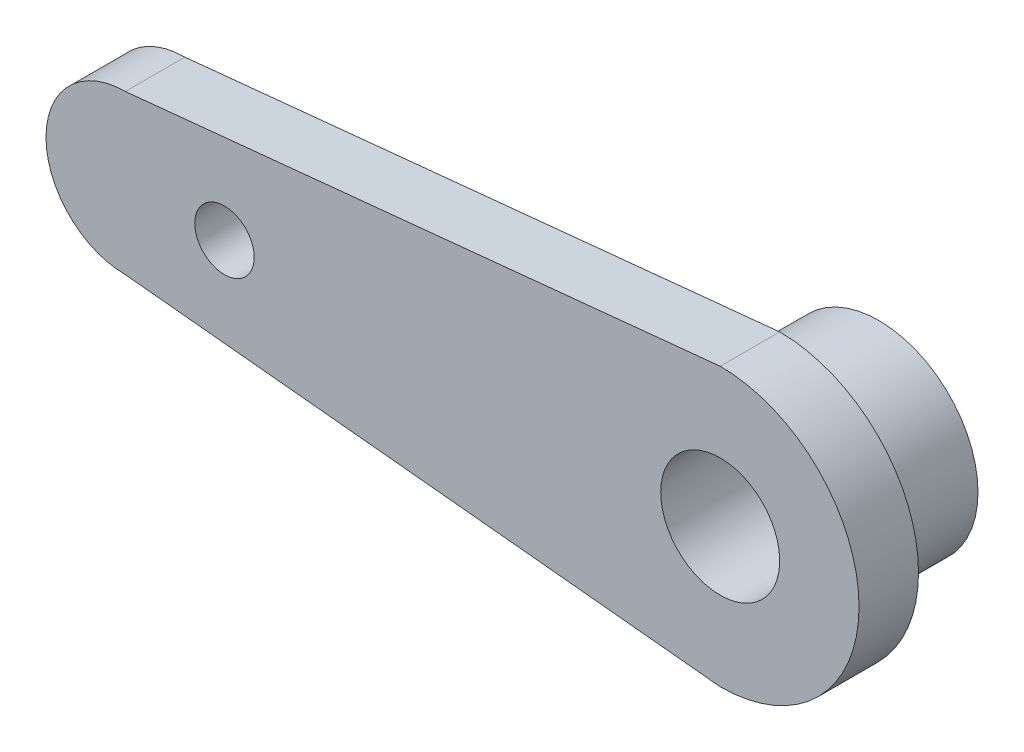
ISO-10303-21;
HEADER;
FILE_DESCRIPTION(('STEP AP214'),'2;1');
FILE_NAME('part.step','',(''),(''),'','','');
FILE_SCHEMA(('AUTOMOTIVE_DESIGN { 1 0 10303 214 1 1 1 1 }'));
ENDSEC;
DATA;
#1=APPLICATION_CONTEXT('core data for automotive mechanical design processes');
#2=APPLICATION_PROTOCOL_DEFINITION('international standard','automotive_design',2000,#1);
#3=PRODUCT_CONTEXT('',#1,'mechanical');
#4=PRODUCT('Part','Part','',(#3));
#5=PRODUCT_RELATED_PRODUCT_CATEGORY('part','',(#4));
#6=PRODUCT_DEFINITION_FORMATION('','',#4);
#7=PRODUCT_DEFINITION_CONTEXT('part definition',#1,'design');
#8=PRODUCT_DEFINITION('design','',#6,#7);
#9=PRODUCT_DEFINITION_SHAPE('','',#8);
#10=(LENGTH_UNIT() NAMED_UNIT(*) SI_UNIT(.MILLI.,.METRE.));
#11=(NAMED_UNIT(*) PLANE_ANGLE_UNIT() SI_UNIT($,.RADIAN.));
#12=(NAMED_UNIT(*) SI_UNIT($,.STERADIAN.) SOLID_ANGLE_UNIT());
#13=UNCERTAINTY_MEASURE_WITH_UNIT(LENGTH_MEASURE(1.E-05),#10,'distance_accuracy_value','');
#14=(GEOMETRIC_REPRESENTATION_CONTEXT(3) GLOBAL_UNCERTAINTY_ASSIGNED_CONTEXT((#13)) GLOBAL_UNIT_ASSIGNED_CONTEXT((#10,
#11,#12)) REPRESENTATION_CONTEXT('',''));
#15=CARTESIAN_POINT('',(0.,0.,0.));
#16=DIRECTION('',(0.,0.,1.));
#17=DIRECTION('',(1.,0.,0.));
#18=AXIS2_PLACEMENT_3D('',#15,#16,#17);
#19=CARTESIAN_POINT('',(0.,0.,0.));
#20=DIRECTION('',(0.,0.,1.));
#21=DIRECTION('',(1.,0.,0.));
#22=AXIS2_PLACEMENT_3D('',#19,#20,#21);
#23=PLANE('',#22);
#24=CARTESIAN_POINT('',(0.,0.,0.));
#25=DIRECTION('',(0.,0.,1.));
#26=DIRECTION('',(1.,0.,0.));
#27=AXIS2_PLACEMENT_3D('',#24,#25,#26);
#28=CIRCLE('',#27,5.);
#29=CARTESIAN_POINT('',(5.,0.,0.));
#30=VERTEX_POINT('',#29);
#31=EDGE_CURVE('E36',#30,#30,#28,.T.);
#32=ORIENTED_EDGE('',*,*,#31,.F.);
#33=EDGE_LOOP('',(#32));
#34=FACE_BOUND('',#33,.T.);
#35=CARTESIAN_POINT('',(0.,0.,0.));
#36=DIRECTION('',(0.,0.,1.));
#37=DIRECTION('',(1.,0.,0.));
#38=AXIS2_PLACEMENT_3D('',#35,#36,#37);
#39=CIRCLE('',#38,3.);
#40=CARTESIAN_POINT('',(3.,0.,0.));
#41=VERTEX_POINT('',#40);
#42=EDGE_CURVE('E110',#41,#41,#39,.T.);
#43=ORIENTED_EDGE('',*,*,#42,.T.);
#44=EDGE_LOOP('',(#43));
#45=FACE_BOUND('',#44,.T.);
#46=ADVANCED_FACE('F32',(#34,#45),#23,.F.);
#47=CARTESIAN_POINT('',(0.,0.,5.));
#48=DIRECTION('',(0.,0.,-1.));
#49=DIRECTION('',(-1.,0.,0.));
#50=AXIS2_PLACEMENT_3D('',#47,#48,#49);
#51=CYLINDRICAL_SURFACE('',#50,5.);
#52=CARTESIAN_POINT('',(0.,0.,5.));
#53=DIRECTION('',(0.,0.,1.));
#54=DIRECTION('',(1.,0.,0.));
#55=AXIS2_PLACEMENT_3D('',#52,#53,#54);
#56=CIRCLE('',#55,5.);
#57=CARTESIAN_POINT('',(5.,0.,5.));
#58=VERTEX_POINT('',#57);
#59=EDGE_CURVE('E11',#58,#58,#56,.T.);
#60=ORIENTED_EDGE('',*,*,#59,.F.);
#61=EDGE_LOOP('',(#60));
#62=FACE_BOUND('',#61,.T.);
#63=ORIENTED_EDGE('',*,*,#31,.T.);
#64=EDGE_LOOP('',(#63));
#65=FACE_BOUND('',#64,.T.);
#66=ADVANCED_FACE('F34',(#62,#65),#51,.T.);
#67=CARTESIAN_POINT('',(0.,0.,5.));
#68=DIRECTION('',(0.,0.,-1.));
#69=DIRECTION('',(-1.,0.,0.));
#70=AXIS2_PLACEMENT_3D('',#67,#68,#69);
#71=CYLINDRICAL_SURFACE('',#70,3.);
#72=ORIENTED_EDGE('',*,*,#42,.F.);
#73=EDGE_LOOP('',(#72));
#74=FACE_BOUND('',#73,.T.);
#75=CARTESIAN_POINT('',(0.,0.,8.));
#76=DIRECTION('',(0.,0.,-1.));
#77=DIRECTION('',(-1.,0.,0.));
#78=AXIS2_PLACEMENT_3D('',#75,#76,#77);
#79=CIRCLE('',#78,3.);
#80=CARTESIAN_POINT('',(-3.,0.,8.));
#81=VERTEX_POINT('',#80);
#82=EDGE_CURVE('E157',#81,#81,#79,.T.);
#83=ORIENTED_EDGE('',*,*,#82,.F.);
#84=EDGE_LOOP('',(#83));
#85=FACE_BOUND('',#84,.T.);
#86=ADVANCED_FACE('F122',(#74,#85),#71,.F.);
#87=CARTESIAN_POINT('',(-30.,0.,8.));
#88=DIRECTION('',(0.,0.,-1.));
#89=DIRECTION('',(-1.,0.,0.));
#90=AXIS2_PLACEMENT_3D('',#87,#88,#89);
#91=CYLINDRICAL_SURFACE('',#90,4.);
#92=CARTESIAN_POINT('',(-30.,0.,5.));
#93=DIRECTION('',(0.,0.,1.));
#94=DIRECTION('',(1.,0.,0.));
#95=AXIS2_PLACEMENT_3D('',#92,#93,#94);
#96=CIRCLE('',#95,4.);
#97=CARTESIAN_POINT('',(-30.,4.,5.));
#98=VERTEX_POINT('',#97);
#99=CARTESIAN_POINT('',(-30.,-4.,5.));
#100=VERTEX_POINT('',#99);
#101=EDGE_CURVE('E100',#98,#100,#96,.T.);
#102=ORIENTED_EDGE('',*,*,#101,.T.);
#103=DIRECTION('',(0.,0.,-1.));
#104=VECTOR('',#103,1.);
#105=CARTESIAN_POINT('',(-30.,-4.,8.));
#106=LINE('',#105,#104);
#107=CARTESIAN_POINT('',(-30.,-4.,8.));
#108=VERTEX_POINT('',#107);
#109=EDGE_CURVE('E91',#108,#100,#106,.T.);
#110=ORIENTED_EDGE('',*,*,#109,.F.);
#111=CARTESIAN_POINT('',(-30.,0.,8.));
#112=DIRECTION('',(0.,0.,1.));
#113=DIRECTION('',(1.,0.,0.));
#114=AXIS2_PLACEMENT_3D('',#111,#112,#113);
#115=CIRCLE('',#114,4.);
#116=CARTESIAN_POINT('',(-30.,4.,8.));
#117=VERTEX_POINT('',#116);
#118=EDGE_CURVE('E85',#117,#108,#115,.T.);
#119=ORIENTED_EDGE('',*,*,#118,.F.);
#120=DIRECTION('',(0.,0.,-1.));
#121=VECTOR('',#120,1.);
#122=CARTESIAN_POINT('',(-30.,4.,8.));
#123=LINE('',#122,#121);
#124=EDGE_CURVE('E96',#117,#98,#123,.T.);
#125=ORIENTED_EDGE('',*,*,#124,.T.);
#126=EDGE_LOOP('',(#102,#110,#119,#125));
#127=FACE_BOUND('',#126,.T.);
#128=ADVANCED_FACE('F127',(#127),#91,.T.);
#129=CARTESIAN_POINT('',(-30.,-4.,8.));
#130=DIRECTION('',(0.099503719020999,0.995037190209989,0.));
#131=DIRECTION('',(-0.995037190209989,0.099503719020999,0.));
#132=AXIS2_PLACEMENT_3D('',#129,#130,#131);
#133=PLANE('',#132);
#134=DIRECTION('',(0.995037190209989,-0.0995037190209989,0.));
#135=VECTOR('',#134,1.);
#136=CARTESIAN_POINT('',(-30.,-4.,5.));
#137=LINE('',#136,#135);
#138=CARTESIAN_POINT('',(0.,-7.,5.));
#139=VERTEX_POINT('',#138);
#140=EDGE_CURVE('E90',#100,#139,#137,.T.);
#141=ORIENTED_EDGE('',*,*,#140,.T.);
#142=DIRECTION('',(0.,0.,-1.));
#143=VECTOR('',#142,1.);
#144=CARTESIAN_POINT('',(0.,-7.,8.));
#145=LINE('',#144,#143);
#146=CARTESIAN_POINT('',(0.,-7.,8.));
#147=VERTEX_POINT('',#146);
#148=EDGE_CURVE('E88',#147,#139,#145,.T.);
#149=ORIENTED_EDGE('',*,*,#148,.F.);
#150=DIRECTION('',(0.995037190209989,-0.0995037190209989,0.));
#151=VECTOR('',#150,1.);
#152=CARTESIAN_POINT('',(-30.,-4.,8.));
#153=LINE('',#152,#151);
#154=EDGE_CURVE('E80',#108,#147,#153,.T.);
#155=ORIENTED_EDGE('',*,*,#154,.F.);
#156=ORIENTED_EDGE('',*,*,#109,.T.);
#157=EDGE_LOOP('',(#141,#149,#155,#156));
#158=FACE_BOUND('',#157,.T.);
#159=ADVANCED_FACE('F89',(#158),#133,.F.);
#160=CARTESIAN_POINT('',(0.,0.,8.));
#161=DIRECTION('',(0.,0.,-1.));
#162=DIRECTION('',(-1.,0.,0.));
#163=AXIS2_PLACEMENT_3D('',#160,#161,#162);
#164=CYLINDRICAL_SURFACE('',#163,7.);
#165=CARTESIAN_POINT('',(0.,0.,5.));
#166=DIRECTION('',(0.,0.,1.));
#167=DIRECTION('',(1.,0.,0.));
#168=AXIS2_PLACEMENT_3D('',#165,#166,#167);
#169=CIRCLE('',#168,7.);
#170=CARTESIAN_POINT('',(0.,7.,5.));
#171=VERTEX_POINT('',#170);
#172=EDGE_CURVE('E66',#139,#171,#169,.T.);
#173=ORIENTED_EDGE('',*,*,#172,.T.);
#174=DIRECTION('',(0.,0.,-1.));
#175=VECTOR('',#174,1.);
#176=CARTESIAN_POINT('',(0.,7.,8.));
#177=LINE('',#176,#175);
#178=CARTESIAN_POINT('',(0.,7.,8.));
#179=VERTEX_POINT('',#178);
#180=EDGE_CURVE('E92',#179,#171,#177,.T.);
#181=ORIENTED_EDGE('',*,*,#180,.F.);
#182=CARTESIAN_POINT('',(0.,0.,8.));
#183=DIRECTION('',(0.,0.,1.));
#184=DIRECTION('',(1.,0.,0.));
#185=AXIS2_PLACEMENT_3D('',#182,#183,#184);
#186=CIRCLE('',#185,7.);
#187=EDGE_CURVE('E83',#147,#179,#186,.T.);
#188=ORIENTED_EDGE('',*,*,#187,.F.);
#189=ORIENTED_EDGE('',*,*,#148,.T.);
#190=EDGE_LOOP('',(#173,#181,#188,#189));
#191=FACE_BOUND('',#190,.T.);
#192=ADVANCED_FACE('F94',(#191),#164,.T.);
#193=CARTESIAN_POINT('',(-30.,4.,8.));
#194=DIRECTION('',(0.099503719020999,-0.995037190209989,0.));
#195=DIRECTION('',(0.995037190209989,0.099503719020999,0.));
#196=AXIS2_PLACEMENT_3D('',#193,#194,#195);
#197=PLANE('',#196);
#198=DIRECTION('',(-0.995037190209989,-0.0995037190209989,0.));
#199=VECTOR('',#198,1.);
#200=CARTESIAN_POINT('',(-30.,4.,5.));
#201=LINE('',#200,#199);
#202=EDGE_CURVE('E72',#171,#98,#201,.T.);
#203=ORIENTED_EDGE('',*,*,#202,.T.);
#204=ORIENTED_EDGE('',*,*,#124,.F.);
#205=DIRECTION('',(-0.995037190209989,-0.0995037190209989,0.));
#206=VECTOR('',#205,1.);
#207=CARTESIAN_POINT('',(-30.,4.,8.));
#208=LINE('',#207,#206);
#209=EDGE_CURVE('E49',#179,#117,#208,.T.);
#210=ORIENTED_EDGE('',*,*,#209,.F.);
#211=ORIENTED_EDGE('',*,*,#180,.T.);
#212=EDGE_LOOP('',(#203,#204,#210,#211));
#213=FACE_BOUND('',#212,.T.);
#214=ADVANCED_FACE('F136',(#213),#197,.F.);
#215=CARTESIAN_POINT('',(-30.,0.,8.));
#216=DIRECTION('',(0.,0.,1.));
#217=DIRECTION('',(1.,0.,0.));
#218=AXIS2_PLACEMENT_3D('',#215,#216,#217);
#219=PLANE('',#218);
#220=ORIENTED_EDGE('',*,*,#82,.T.);
#221=EDGE_LOOP('',(#220));
#222=FACE_BOUND('',#221,.T.);
#223=CARTESIAN_POINT('',(-25.,0.,8.));
#224=DIRECTION('',(0.,0.,-1.));
#225=DIRECTION('',(-1.,0.,0.));
#226=AXIS2_PLACEMENT_3D('',#223,#224,#225);
#227=CIRCLE('',#226,1.5);
#228=CARTESIAN_POINT('',(-26.5,0.,8.));
#229=VERTEX_POINT('',#228);
#230=EDGE_CURVE('E103',#229,#229,#227,.T.);
#231=ORIENTED_EDGE('',*,*,#230,.T.);
#232=EDGE_LOOP('',(#231));
#233=FACE_BOUND('',#232,.T.);
#234=ORIENTED_EDGE('',*,*,#118,.T.);
#235=ORIENTED_EDGE('',*,*,#154,.T.);
#236=ORIENTED_EDGE('',*,*,#187,.T.);
#237=ORIENTED_EDGE('',*,*,#209,.T.);
#238=EDGE_LOOP('',(#234,#235,#236,#237));
#239=FACE_BOUND('',#238,.T.);
#240=ADVANCED_FACE('F81',(#222,#233,#239),#219,.T.);
#241=CARTESIAN_POINT('',(-30.,0.,5.));
#242=DIRECTION('',(0.,0.,1.));
#243=DIRECTION('',(1.,0.,0.));
#244=AXIS2_PLACEMENT_3D('',#241,#242,#243);
#245=PLANE('',#244);
#246=CARTESIAN_POINT('',(-25.,0.,5.));
#247=DIRECTION('',(0.,0.,-1.));
#248=DIRECTION('',(-1.,0.,0.));
#249=AXIS2_PLACEMENT_3D('',#246,#247,#248);
#250=CIRCLE('',#249,1.5);
#251=CARTESIAN_POINT('',(-26.5,0.,5.));
#252=VERTEX_POINT('',#251);
#253=EDGE_CURVE('E156',#252,#252,#250,.T.);
#254=ORIENTED_EDGE('',*,*,#253,.F.);
#255=EDGE_LOOP('',(#254));
#256=FACE_BOUND('',#255,.T.);
#257=ORIENTED_EDGE('',*,*,#59,.T.);
#258=EDGE_LOOP('',(#257));
#259=FACE_BOUND('',#258,.T.);
#260=ORIENTED_EDGE('',*,*,#101,.F.);
#261=ORIENTED_EDGE('',*,*,#202,.F.);
#262=ORIENTED_EDGE('',*,*,#172,.F.);
#263=ORIENTED_EDGE('',*,*,#140,.F.);
#264=EDGE_LOOP('',(#260,#261,#262,#263));
#265=FACE_BOUND('',#264,.T.);
#266=ADVANCED_FACE('F139',(#256,#259,#265),#245,.F.);
#267=CARTESIAN_POINT('',(-25.,0.,8.));
#268=DIRECTION('',(0.,0.,-1.));
#269=DIRECTION('',(-1.,0.,0.));
#270=AXIS2_PLACEMENT_3D('',#267,#268,#269);
#271=CYLINDRICAL_SURFACE('',#270,1.5);
#272=ORIENTED_EDGE('',*,*,#230,.F.);
#273=EDGE_LOOP('',(#272));
#274=FACE_BOUND('',#273,.T.);
#275=ORIENTED_EDGE('',*,*,#253,.T.);
#276=EDGE_LOOP('',(#275));
#277=FACE_BOUND('',#276,.T.);
#278=ADVANCED_FACE('F142',(#274,#277),#271,.F.);
#279=CLOSED_SHELL('',(#46,#66,#86,#128,#159,#192,#214,#240,#266,#278));
#280=MANIFOLD_SOLID_BREP('B2',#279);
#281=ADVANCED_BREP_SHAPE_REPRESENTATION('',(#18,#280),#14);
#282=SHAPE_DEFINITION_REPRESENTATION(#9,#281);
ENDSEC;
END-ISO-10303-21;
